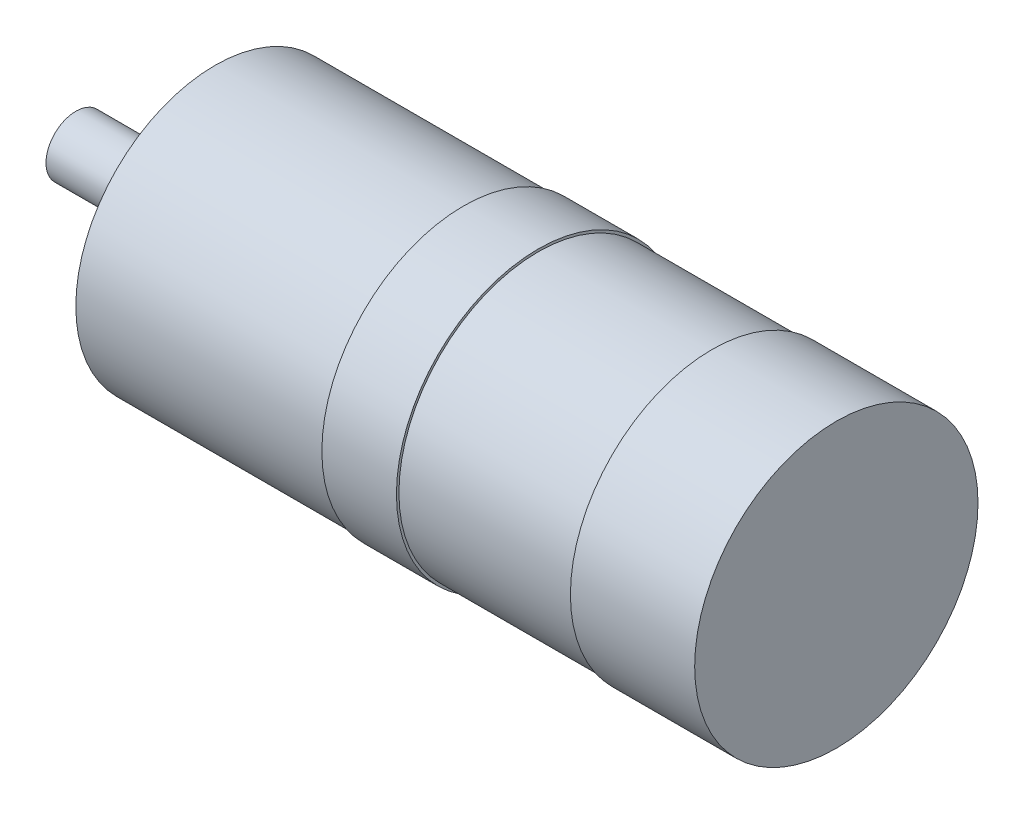
ISO-10303-21;
HEADER;
FILE_DESCRIPTION(('STEP AP214'),'2;1');
FILE_NAME('part.step','',(''),(''),'','','');
FILE_SCHEMA(('AUTOMOTIVE_DESIGN { 1 0 10303 214 1 1 1 1 }'));
ENDSEC;
DATA;
#1=APPLICATION_CONTEXT('core data for automotive mechanical design processes');
#2=APPLICATION_PROTOCOL_DEFINITION('international standard','automotive_design',2000,#1);
#3=PRODUCT_CONTEXT('',#1,'mechanical');
#4=PRODUCT('Part','Part','',(#3));
#5=PRODUCT_RELATED_PRODUCT_CATEGORY('part','',(#4));
#6=PRODUCT_DEFINITION_FORMATION('','',#4);
#7=PRODUCT_DEFINITION_CONTEXT('part definition',#1,'design');
#8=PRODUCT_DEFINITION('design','',#6,#7);
#9=PRODUCT_DEFINITION_SHAPE('','',#8);
#10=(LENGTH_UNIT() NAMED_UNIT(*) SI_UNIT(.MILLI.,.METRE.));
#11=(NAMED_UNIT(*) PLANE_ANGLE_UNIT() SI_UNIT($,.RADIAN.));
#12=(NAMED_UNIT(*) SI_UNIT($,.STERADIAN.) SOLID_ANGLE_UNIT());
#13=UNCERTAINTY_MEASURE_WITH_UNIT(LENGTH_MEASURE(1.E-05),#10,'distance_accuracy_value','');
#14=(GEOMETRIC_REPRESENTATION_CONTEXT(3) GLOBAL_UNCERTAINTY_ASSIGNED_CONTEXT((#13)) GLOBAL_UNIT_ASSIGNED_CONTEXT((#10,
#11,#12)) REPRESENTATION_CONTEXT('',''));
#15=CARTESIAN_POINT('',(0.,0.,0.));
#16=DIRECTION('',(0.,0.,1.));
#17=DIRECTION('',(1.,0.,0.));
#18=AXIS2_PLACEMENT_3D('',#15,#16,#17);
#19=CARTESIAN_POINT('',(-903.237381768934,0.,0.));
#20=DIRECTION('',(-1.,0.,0.));
#21=DIRECTION('',(0.,0.,1.));
#22=AXIS2_PLACEMENT_3D('',#19,#20,#21);
#23=CYLINDRICAL_SURFACE('',#22,6.);
#24=CARTESIAN_POINT('',(0.,0.,0.));
#25=DIRECTION('',(-1.,0.,0.));
#26=DIRECTION('',(0.,0.,1.));
#27=AXIS2_PLACEMENT_3D('',#24,#25,#26);
#28=CIRCLE('',#27,6.);
#29=CARTESIAN_POINT('',(0.,0.,6.));
#30=VERTEX_POINT('',#29);
#31=EDGE_CURVE('E67',#30,#30,#28,.T.);
#32=ORIENTED_EDGE('',*,*,#31,.F.);
#33=EDGE_LOOP('',(#32));
#34=FACE_BOUND('',#33,.T.);
#35=CARTESIAN_POINT('',(16.,0.,0.));
#36=DIRECTION('',(1.,0.,0.));
#37=DIRECTION('',(0.,0.,-1.));
#38=AXIS2_PLACEMENT_3D('',#35,#36,#37);
#39=CIRCLE('',#38,6.);
#40=CARTESIAN_POINT('',(16.,6.,0.));
#41=VERTEX_POINT('',#40);
#42=CARTESIAN_POINT('',(16.,-6.,0.));
#43=VERTEX_POINT('',#42);
#44=EDGE_CURVE('E11',#41,#43,#39,.T.);
#45=ORIENTED_EDGE('',*,*,#44,.F.);
#46=EDGE_CURVE('E52',#43,#41,#39,.T.);
#47=ORIENTED_EDGE('',*,*,#46,.F.);
#48=EDGE_LOOP('',(#45,#47));
#49=FACE_BOUND('',#48,.T.);
#50=ADVANCED_FACE('F48',(#34,#49),#23,.T.);
#51=CARTESIAN_POINT('',(0.,0.,0.));
#52=DIRECTION('',(1.,0.,0.));
#53=DIRECTION('',(0.,0.,-1.));
#54=AXIS2_PLACEMENT_3D('',#51,#52,#53);
#55=PLANE('',#54);
#56=ORIENTED_EDGE('',*,*,#31,.T.);
#57=EDGE_LOOP('',(#56));
#58=FACE_BOUND('',#57,.T.);
#59=ADVANCED_FACE('F50',(#58),#55,.F.);
#60=ORIENTED_EDGE('',*,*,#46,.T.);
#61=ORIENTED_EDGE('',*,*,#44,.T.);
#62=EDGE_LOOP('',(#60,#61));
#63=FACE_BOUND('',#62,.T.);
#64=CARTESIAN_POINT('',(26.,0.,0.));
#65=DIRECTION('',(-1.,0.,0.));
#66=DIRECTION('',(0.,0.,1.));
#67=AXIS2_PLACEMENT_3D('',#64,#65,#66);
#68=CIRCLE('',#67,6.);
#69=CARTESIAN_POINT('',(26.,0.,6.));
#70=VERTEX_POINT('',#69);
#71=EDGE_CURVE('E71',#70,#70,#68,.T.);
#72=ORIENTED_EDGE('',*,*,#71,.T.);
#73=EDGE_LOOP('',(#72));
#74=FACE_BOUND('',#73,.T.);
#75=ADVANCED_FACE('F64',(#63,#74),#23,.T.);
#76=CARTESIAN_POINT('',(26.,6.,0.));
#77=DIRECTION('',(1.,0.,0.));
#78=DIRECTION('',(0.,0.,-1.));
#79=AXIS2_PLACEMENT_3D('',#76,#77,#78);
#80=PLANE('',#79);
#81=ORIENTED_EDGE('',*,*,#71,.F.);
#82=EDGE_LOOP('',(#81));
#83=FACE_BOUND('',#82,.T.);
#84=CARTESIAN_POINT('',(26.,0.,0.));
#85=DIRECTION('',(-1.,0.,0.));
#86=DIRECTION('',(0.,0.,1.));
#87=AXIS2_PLACEMENT_3D('',#84,#85,#86);
#88=CIRCLE('',#87,16.);
#89=CARTESIAN_POINT('',(26.,0.,16.));
#90=VERTEX_POINT('',#89);
#91=EDGE_CURVE('E76',#90,#90,#88,.T.);
#92=ORIENTED_EDGE('',*,*,#91,.T.);
#93=EDGE_LOOP('',(#92));
#94=FACE_BOUND('',#93,.T.);
#95=ADVANCED_FACE('F225',(#83,#94),#80,.F.);
#96=CARTESIAN_POINT('',(-903.237381768934,0.,0.));
#97=DIRECTION('',(-1.,0.,0.));
#98=DIRECTION('',(0.,0.,1.));
#99=AXIS2_PLACEMENT_3D('',#96,#97,#98);
#100=CYLINDRICAL_SURFACE('',#99,16.);
#101=ORIENTED_EDGE('',*,*,#91,.F.);
#102=EDGE_LOOP('',(#101));
#103=FACE_BOUND('',#102,.T.);
#104=CARTESIAN_POINT('',(28.,0.,0.));
#105=DIRECTION('',(-1.,0.,0.));
#106=DIRECTION('',(0.,0.,1.));
#107=AXIS2_PLACEMENT_3D('',#104,#105,#106);
#108=CIRCLE('',#107,16.);
#109=CARTESIAN_POINT('',(28.,0.,16.));
#110=VERTEX_POINT('',#109);
#111=EDGE_CURVE('E82',#110,#110,#108,.T.);
#112=ORIENTED_EDGE('',*,*,#111,.T.);
#113=EDGE_LOOP('',(#112));
#114=FACE_BOUND('',#113,.T.);
#115=ADVANCED_FACE('F157',(#103,#114),#100,.T.);
#116=CARTESIAN_POINT('',(28.,16.,0.));
#117=DIRECTION('',(1.,0.,0.));
#118=DIRECTION('',(0.,0.,-1.));
#119=AXIS2_PLACEMENT_3D('',#116,#117,#118);
#120=PLANE('',#119);
#121=CARTESIAN_POINT('',(28.,-15.9099025766973,-15.9099025766973));
#122=DIRECTION('',(-1.,0.,0.));
#123=DIRECTION('',(0.,0.,1.));
#124=AXIS2_PLACEMENT_3D('',#121,#122,#123);
#125=CIRCLE('',#124,2.1);
#126=CARTESIAN_POINT('',(28.,-15.9099025766973,-13.8099025766973));
#127=VERTEX_POINT('',#126);
#128=EDGE_CURVE('E131',#127,#127,#125,.T.);
#129=ORIENTED_EDGE('',*,*,#128,.F.);
#130=EDGE_LOOP('',(#129));
#131=FACE_BOUND('',#130,.T.);
#132=CARTESIAN_POINT('',(28.,-15.9099025766973,15.9099025766973));
#133=DIRECTION('',(-1.,0.,0.));
#134=DIRECTION('',(0.,0.,1.));
#135=AXIS2_PLACEMENT_3D('',#132,#133,#134);
#136=CIRCLE('',#135,2.1);
#137=CARTESIAN_POINT('',(28.,-15.9099025766973,18.0099025766973));
#138=VERTEX_POINT('',#137);
#139=EDGE_CURVE('E139',#138,#138,#136,.T.);
#140=ORIENTED_EDGE('',*,*,#139,.F.);
#141=EDGE_LOOP('',(#140));
#142=FACE_BOUND('',#141,.T.);
#143=CARTESIAN_POINT('',(28.,15.9099025766973,15.9099025766973));
#144=DIRECTION('',(-1.,0.,0.));
#145=DIRECTION('',(0.,0.,1.));
#146=AXIS2_PLACEMENT_3D('',#143,#144,#145);
#147=CIRCLE('',#146,2.1);
#148=CARTESIAN_POINT('',(28.,15.9099025766973,18.0099025766973));
#149=VERTEX_POINT('',#148);
#150=EDGE_CURVE('E123',#149,#149,#147,.T.);
#151=ORIENTED_EDGE('',*,*,#150,.F.);
#152=EDGE_LOOP('',(#151));
#153=FACE_BOUND('',#152,.T.);
#154=CARTESIAN_POINT('',(28.,15.9099025766973,-15.9099025766973));
#155=DIRECTION('',(-1.,0.,0.));
#156=DIRECTION('',(0.,0.,1.));
#157=AXIS2_PLACEMENT_3D('',#154,#155,#156);
#158=CIRCLE('',#157,2.1);
#159=CARTESIAN_POINT('',(28.,15.9099025766973,-13.8099025766973));
#160=VERTEX_POINT('',#159);
#161=EDGE_CURVE('E119',#160,#160,#158,.T.);
#162=ORIENTED_EDGE('',*,*,#161,.F.);
#163=EDGE_LOOP('',(#162));
#164=FACE_BOUND('',#163,.T.);
#165=ORIENTED_EDGE('',*,*,#111,.F.);
#166=EDGE_LOOP('',(#165));
#167=FACE_BOUND('',#166,.T.);
#168=CARTESIAN_POINT('',(28.,0.,0.));
#169=DIRECTION('',(-1.,0.,0.));
#170=DIRECTION('',(0.,0.,1.));
#171=AXIS2_PLACEMENT_3D('',#168,#169,#170);
#172=CIRCLE('',#171,28.);
#173=CARTESIAN_POINT('',(28.,0.,28.));
#174=VERTEX_POINT('',#173);
#175=EDGE_CURVE('E86',#174,#174,#172,.T.);
#176=ORIENTED_EDGE('',*,*,#175,.T.);
#177=EDGE_LOOP('',(#176));
#178=FACE_BOUND('',#177,.T.);
#179=ADVANCED_FACE('F153',(#131,#142,#153,#164,#167,#178),#120,.F.);
#180=CARTESIAN_POINT('',(-903.237381768934,0.,0.));
#181=DIRECTION('',(-1.,0.,0.));
#182=DIRECTION('',(0.,0.,1.));
#183=AXIS2_PLACEMENT_3D('',#180,#181,#182);
#184=CYLINDRICAL_SURFACE('',#183,28.);
#185=ORIENTED_EDGE('',*,*,#175,.F.);
#186=EDGE_LOOP('',(#185));
#187=FACE_BOUND('',#186,.T.);
#188=CARTESIAN_POINT('',(78.,0.,0.));
#189=DIRECTION('',(-1.,0.,0.));
#190=DIRECTION('',(0.,0.,1.));
#191=AXIS2_PLACEMENT_3D('',#188,#189,#190);
#192=CIRCLE('',#191,28.);
#193=CARTESIAN_POINT('',(78.,0.,28.));
#194=VERTEX_POINT('',#193);
#195=EDGE_CURVE('E90',#194,#194,#192,.T.);
#196=ORIENTED_EDGE('',*,*,#195,.T.);
#197=EDGE_LOOP('',(#196));
#198=FACE_BOUND('',#197,.T.);
#199=ADVANCED_FACE('F156',(#187,#198),#184,.T.);
#200=CARTESIAN_POINT('',(78.,28.,0.));
#201=DIRECTION('',(1.,0.,0.));
#202=DIRECTION('',(0.,0.,-1.));
#203=AXIS2_PLACEMENT_3D('',#200,#201,#202);
#204=PLANE('',#203);
#205=ORIENTED_EDGE('',*,*,#195,.F.);
#206=EDGE_LOOP('',(#205));
#207=FACE_BOUND('',#206,.T.);
#208=CARTESIAN_POINT('',(78.,0.,0.));
#209=DIRECTION('',(-1.,0.,0.));
#210=DIRECTION('',(0.,0.,1.));
#211=AXIS2_PLACEMENT_3D('',#208,#209,#210);
#212=CIRCLE('',#211,28.5);
#213=CARTESIAN_POINT('',(78.,0.,28.5));
#214=VERTEX_POINT('',#213);
#215=EDGE_CURVE('E94',#214,#214,#212,.T.);
#216=ORIENTED_EDGE('',*,*,#215,.T.);
#217=EDGE_LOOP('',(#216));
#218=FACE_BOUND('',#217,.T.);
#219=ADVANCED_FACE('F168',(#207,#218),#204,.F.);
#220=CARTESIAN_POINT('',(-903.237381768934,0.,0.));
#221=DIRECTION('',(-1.,0.,0.));
#222=DIRECTION('',(0.,0.,1.));
#223=AXIS2_PLACEMENT_3D('',#220,#221,#222);
#224=CYLINDRICAL_SURFACE('',#223,28.5);
#225=ORIENTED_EDGE('',*,*,#215,.F.);
#226=EDGE_LOOP('',(#225));
#227=FACE_BOUND('',#226,.T.);
#228=CARTESIAN_POINT('',(93.,0.,0.));
#229=DIRECTION('',(-1.,0.,0.));
#230=DIRECTION('',(0.,0.,1.));
#231=AXIS2_PLACEMENT_3D('',#228,#229,#230);
#232=CIRCLE('',#231,28.5);
#233=CARTESIAN_POINT('',(93.,0.,28.5));
#234=VERTEX_POINT('',#233);
#235=EDGE_CURVE('E98',#234,#234,#232,.T.);
#236=ORIENTED_EDGE('',*,*,#235,.T.);
#237=EDGE_LOOP('',(#236));
#238=FACE_BOUND('',#237,.T.);
#239=ADVANCED_FACE('F174',(#227,#238),#224,.T.);
#240=CARTESIAN_POINT('',(93.,28.5,0.));
#241=DIRECTION('',(-1.,0.,0.));
#242=DIRECTION('',(0.,0.,1.));
#243=AXIS2_PLACEMENT_3D('',#240,#241,#242);
#244=PLANE('',#243);
#245=ORIENTED_EDGE('',*,*,#235,.F.);
#246=EDGE_LOOP('',(#245));
#247=FACE_BOUND('',#246,.T.);
#248=CARTESIAN_POINT('',(93.,0.,0.));
#249=DIRECTION('',(-1.,0.,0.));
#250=DIRECTION('',(0.,0.,1.));
#251=AXIS2_PLACEMENT_3D('',#248,#249,#250);
#252=CIRCLE('',#251,28.);
#253=CARTESIAN_POINT('',(93.,0.,28.));
#254=VERTEX_POINT('',#253);
#255=EDGE_CURVE('E102',#254,#254,#252,.T.);
#256=ORIENTED_EDGE('',*,*,#255,.T.);
#257=EDGE_LOOP('',(#256));
#258=FACE_BOUND('',#257,.T.);
#259=ADVANCED_FACE('F180',(#247,#258),#244,.F.);
#260=CARTESIAN_POINT('',(-903.237381768934,0.,0.));
#261=DIRECTION('',(-1.,0.,0.));
#262=DIRECTION('',(0.,0.,1.));
#263=AXIS2_PLACEMENT_3D('',#260,#261,#262);
#264=CYLINDRICAL_SURFACE('',#263,28.);
#265=ORIENTED_EDGE('',*,*,#255,.F.);
#266=EDGE_LOOP('',(#265));
#267=FACE_BOUND('',#266,.T.);
#268=CARTESIAN_POINT('',(128.,0.,0.));
#269=DIRECTION('',(-1.,0.,0.));
#270=DIRECTION('',(0.,0.,1.));
#271=AXIS2_PLACEMENT_3D('',#268,#269,#270);
#272=CIRCLE('',#271,28.);
#273=CARTESIAN_POINT('',(128.,0.,28.));
#274=VERTEX_POINT('',#273);
#275=EDGE_CURVE('E106',#274,#274,#272,.T.);
#276=ORIENTED_EDGE('',*,*,#275,.T.);
#277=EDGE_LOOP('',(#276));
#278=FACE_BOUND('',#277,.T.);
#279=ADVANCED_FACE('F186',(#267,#278),#264,.T.);
#280=CARTESIAN_POINT('',(128.,28.,0.));
#281=DIRECTION('',(1.,0.,0.));
#282=DIRECTION('',(0.,0.,-1.));
#283=AXIS2_PLACEMENT_3D('',#280,#281,#282);
#284=PLANE('',#283);
#285=ORIENTED_EDGE('',*,*,#275,.F.);
#286=EDGE_LOOP('',(#285));
#287=FACE_BOUND('',#286,.T.);
#288=CARTESIAN_POINT('',(128.,0.,0.));
#289=DIRECTION('',(-1.,0.,0.));
#290=DIRECTION('',(0.,0.,1.));
#291=AXIS2_PLACEMENT_3D('',#288,#289,#290);
#292=CIRCLE('',#291,28.5);
#293=CARTESIAN_POINT('',(128.,0.,28.5));
#294=VERTEX_POINT('',#293);
#295=EDGE_CURVE('E110',#294,#294,#292,.T.);
#296=ORIENTED_EDGE('',*,*,#295,.T.);
#297=EDGE_LOOP('',(#296));
#298=FACE_BOUND('',#297,.T.);
#299=ADVANCED_FACE('F192',(#287,#298),#284,.F.);
#300=CARTESIAN_POINT('',(-903.237381768934,0.,0.));
#301=DIRECTION('',(-1.,0.,0.));
#302=DIRECTION('',(0.,0.,1.));
#303=AXIS2_PLACEMENT_3D('',#300,#301,#302);
#304=CYLINDRICAL_SURFACE('',#303,28.5);
#305=ORIENTED_EDGE('',*,*,#295,.F.);
#306=EDGE_LOOP('',(#305));
#307=FACE_BOUND('',#306,.T.);
#308=CARTESIAN_POINT('',(153.,0.,0.));
#309=DIRECTION('',(-1.,0.,0.));
#310=DIRECTION('',(0.,0.,1.));
#311=AXIS2_PLACEMENT_3D('',#308,#309,#310);
#312=CIRCLE('',#311,28.5);
#313=CARTESIAN_POINT('',(153.,0.,28.5));
#314=VERTEX_POINT('',#313);
#315=EDGE_CURVE('E114',#314,#314,#312,.T.);
#316=ORIENTED_EDGE('',*,*,#315,.T.);
#317=EDGE_LOOP('',(#316));
#318=FACE_BOUND('',#317,.T.);
#319=ADVANCED_FACE('F198',(#307,#318),#304,.T.);
#320=CARTESIAN_POINT('',(153.,28.5,0.));
#321=DIRECTION('',(-1.,0.,0.));
#322=DIRECTION('',(0.,0.,1.));
#323=AXIS2_PLACEMENT_3D('',#320,#321,#322);
#324=PLANE('',#323);
#325=ORIENTED_EDGE('',*,*,#315,.F.);
#326=EDGE_LOOP('',(#325));
#327=FACE_BOUND('',#326,.T.);
#328=ADVANCED_FACE('F204',(#327),#324,.F.);
#329=CARTESIAN_POINT('',(34.5,15.9099025766973,-15.9099025766973));
#330=DIRECTION('',(-1.,0.,0.));
#331=DIRECTION('',(0.,0.,1.));
#332=AXIS2_PLACEMENT_3D('',#329,#330,#331);
#333=CYLINDRICAL_SURFACE('',#332,2.1);
#334=CARTESIAN_POINT('',(34.5,15.9099025766973,-15.9099025766973));
#335=DIRECTION('',(-1.,0.,0.));
#336=DIRECTION('',(0.,0.,1.));
#337=AXIS2_PLACEMENT_3D('',#334,#335,#336);
#338=CIRCLE('',#337,2.1);
#339=CARTESIAN_POINT('',(34.5,15.9099025766973,-13.8099025766973));
#340=VERTEX_POINT('',#339);
#341=EDGE_CURVE('E118',#340,#340,#338,.T.);
#342=ORIENTED_EDGE('',*,*,#341,.F.);
#343=EDGE_LOOP('',(#342));
#344=FACE_BOUND('',#343,.T.);
#345=ORIENTED_EDGE('',*,*,#161,.T.);
#346=EDGE_LOOP('',(#345));
#347=FACE_BOUND('',#346,.T.);
#348=ADVANCED_FACE('F209',(#344,#347),#333,.F.);
#349=CARTESIAN_POINT('',(34.5,15.9099025766973,-15.9099025766973));
#350=DIRECTION('',(-1.,0.,0.));
#351=DIRECTION('',(0.,0.,1.));
#352=AXIS2_PLACEMENT_3D('',#349,#350,#351);
#353=PLANE('',#352);
#354=ORIENTED_EDGE('',*,*,#341,.T.);
#355=EDGE_LOOP('',(#354));
#356=FACE_BOUND('',#355,.T.);
#357=ADVANCED_FACE('F214',(#356),#353,.T.);
#358=CARTESIAN_POINT('',(34.5,15.9099025766973,15.9099025766973));
#359=DIRECTION('',(-1.,0.,0.));
#360=DIRECTION('',(0.,0.,1.));
#361=AXIS2_PLACEMENT_3D('',#358,#359,#360);
#362=CYLINDRICAL_SURFACE('',#361,2.1);
#363=CARTESIAN_POINT('',(34.5,15.9099025766973,15.9099025766973));
#364=DIRECTION('',(-1.,0.,0.));
#365=DIRECTION('',(0.,0.,1.));
#366=AXIS2_PLACEMENT_3D('',#363,#364,#365);
#367=CIRCLE('',#366,2.1);
#368=CARTESIAN_POINT('',(34.5,15.9099025766973,18.0099025766973));
#369=VERTEX_POINT('',#368);
#370=EDGE_CURVE('E143',#369,#369,#367,.T.);
#371=ORIENTED_EDGE('',*,*,#370,.F.);
#372=EDGE_LOOP('',(#371));
#373=FACE_BOUND('',#372,.T.);
#374=ORIENTED_EDGE('',*,*,#150,.T.);
#375=EDGE_LOOP('',(#374));
#376=FACE_BOUND('',#375,.T.);
#377=ADVANCED_FACE('F151',(#373,#376),#362,.F.);
#378=CARTESIAN_POINT('',(34.5,15.9099025766973,15.9099025766973));
#379=DIRECTION('',(-1.,0.,0.));
#380=DIRECTION('',(0.,0.,1.));
#381=AXIS2_PLACEMENT_3D('',#378,#379,#380);
#382=PLANE('',#381);
#383=ORIENTED_EDGE('',*,*,#370,.T.);
#384=EDGE_LOOP('',(#383));
#385=FACE_BOUND('',#384,.T.);
#386=ADVANCED_FACE('F306',(#385),#382,.T.);
#387=CARTESIAN_POINT('',(34.5,-15.9099025766973,15.9099025766973));
#388=DIRECTION('',(-1.,0.,0.));
#389=DIRECTION('',(0.,0.,1.));
#390=AXIS2_PLACEMENT_3D('',#387,#388,#389);
#391=CYLINDRICAL_SURFACE('',#390,2.1);
#392=CARTESIAN_POINT('',(34.5,-15.9099025766973,15.9099025766973));
#393=DIRECTION('',(-1.,0.,0.));
#394=DIRECTION('',(0.,0.,1.));
#395=AXIS2_PLACEMENT_3D('',#392,#393,#394);
#396=CIRCLE('',#395,2.1);
#397=CARTESIAN_POINT('',(34.5,-15.9099025766973,18.0099025766973));
#398=VERTEX_POINT('',#397);
#399=EDGE_CURVE('E135',#398,#398,#396,.T.);
#400=ORIENTED_EDGE('',*,*,#399,.F.);
#401=EDGE_LOOP('',(#400));
#402=FACE_BOUND('',#401,.T.);
#403=ORIENTED_EDGE('',*,*,#139,.T.);
#404=EDGE_LOOP('',(#403));
#405=FACE_BOUND('',#404,.T.);
#406=ADVANCED_FACE('F316',(#402,#405),#391,.F.);
#407=CARTESIAN_POINT('',(34.5,-15.9099025766973,15.9099025766973));
#408=DIRECTION('',(-1.,0.,0.));
#409=DIRECTION('',(0.,0.,1.));
#410=AXIS2_PLACEMENT_3D('',#407,#408,#409);
#411=PLANE('',#410);
#412=ORIENTED_EDGE('',*,*,#399,.T.);
#413=EDGE_LOOP('',(#412));
#414=FACE_BOUND('',#413,.T.);
#415=ADVANCED_FACE('F326',(#414),#411,.T.);
#416=CARTESIAN_POINT('',(34.5,-15.9099025766973,-15.9099025766973));
#417=DIRECTION('',(-1.,0.,0.));
#418=DIRECTION('',(0.,0.,1.));
#419=AXIS2_PLACEMENT_3D('',#416,#417,#418);
#420=CYLINDRICAL_SURFACE('',#419,2.1);
#421=CARTESIAN_POINT('',(34.5,-15.9099025766973,-15.9099025766973));
#422=DIRECTION('',(-1.,0.,0.));
#423=DIRECTION('',(0.,0.,1.));
#424=AXIS2_PLACEMENT_3D('',#421,#422,#423);
#425=CIRCLE('',#424,2.1);
#426=CARTESIAN_POINT('',(34.5,-15.9099025766973,-13.8099025766973));
#427=VERTEX_POINT('',#426);
#428=EDGE_CURVE('E127',#427,#427,#425,.T.);
#429=ORIENTED_EDGE('',*,*,#428,.F.);
#430=EDGE_LOOP('',(#429));
#431=FACE_BOUND('',#430,.T.);
#432=ORIENTED_EDGE('',*,*,#128,.T.);
#433=EDGE_LOOP('',(#432));
#434=FACE_BOUND('',#433,.T.);
#435=ADVANCED_FACE('F336',(#431,#434),#420,.F.);
#436=CARTESIAN_POINT('',(34.5,-15.9099025766973,-15.9099025766973));
#437=DIRECTION('',(-1.,0.,0.));
#438=DIRECTION('',(0.,0.,1.));
#439=AXIS2_PLACEMENT_3D('',#436,#437,#438);
#440=PLANE('',#439);
#441=ORIENTED_EDGE('',*,*,#428,.T.);
#442=EDGE_LOOP('',(#441));
#443=FACE_BOUND('',#442,.T.);
#444=ADVANCED_FACE('F346',(#443),#440,.T.);
#445=CLOSED_SHELL('',(#50,#59,#75,#95,#115,#179,#199,#219,#239,#259,#279,#299,#319,#328,#348,
#357,#377,#386,#406,#415,#435,#444));
#446=MANIFOLD_SOLID_BREP('B2',#445);
#447=ADVANCED_BREP_SHAPE_REPRESENTATION('',(#18,#446),#14);
#448=SHAPE_DEFINITION_REPRESENTATION(#9,#447);
ENDSEC;
END-ISO-10303-21;
